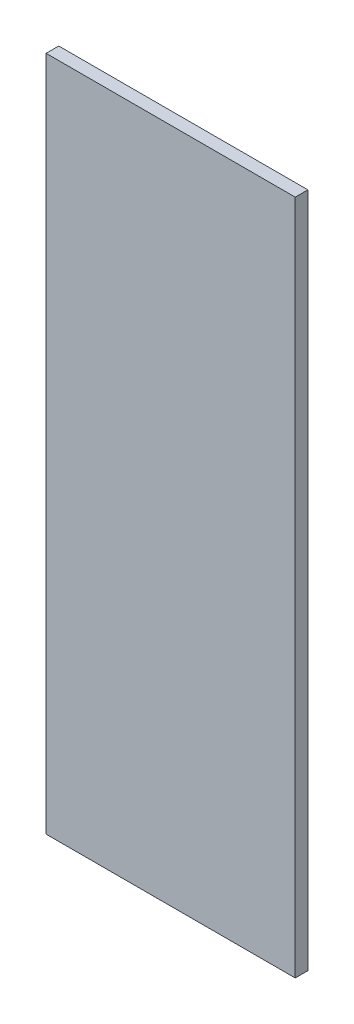
ISO-10303-21;
HEADER;
FILE_DESCRIPTION(('STEP AP214'),'2;1');
FILE_NAME('part.step','',(''),(''),'','','');
FILE_SCHEMA(('AUTOMOTIVE_DESIGN { 1 0 10303 214 1 1 1 1 }'));
ENDSEC;
DATA;
#1=APPLICATION_CONTEXT('core data for automotive mechanical design processes');
#2=APPLICATION_PROTOCOL_DEFINITION('international standard','automotive_design',2000,#1);
#3=PRODUCT_CONTEXT('',#1,'mechanical');
#4=PRODUCT('Part','Part','',(#3));
#5=PRODUCT_RELATED_PRODUCT_CATEGORY('part','',(#4));
#6=PRODUCT_DEFINITION_FORMATION('','',#4);
#7=PRODUCT_DEFINITION_CONTEXT('part definition',#1,'design');
#8=PRODUCT_DEFINITION('design','',#6,#7);
#9=PRODUCT_DEFINITION_SHAPE('','',#8);
#10=(LENGTH_UNIT() NAMED_UNIT(*) SI_UNIT(.MILLI.,.METRE.));
#11=(NAMED_UNIT(*) PLANE_ANGLE_UNIT() SI_UNIT($,.RADIAN.));
#12=(NAMED_UNIT(*) SI_UNIT($,.STERADIAN.) SOLID_ANGLE_UNIT());
#13=UNCERTAINTY_MEASURE_WITH_UNIT(LENGTH_MEASURE(1.E-05),#10,'distance_accuracy_value','');
#14=(GEOMETRIC_REPRESENTATION_CONTEXT(3) GLOBAL_UNCERTAINTY_ASSIGNED_CONTEXT((#13)) GLOBAL_UNIT_ASSIGNED_CONTEXT((#10,
#11,#12)) REPRESENTATION_CONTEXT('',''));
#15=CARTESIAN_POINT('',(0.,0.,0.));
#16=DIRECTION('',(0.,0.,1.));
#17=DIRECTION('',(1.,0.,0.));
#18=AXIS2_PLACEMENT_3D('',#15,#16,#17);
#19=CARTESIAN_POINT('',(85.4420013427734,53.8279991149902,0.));
#20=DIRECTION('',(1.,0.,0.));
#21=DIRECTION('',(0.,-1.,0.));
#22=AXIS2_PLACEMENT_3D('',#19,#20,#21);
#23=PLANE('',#22);
#24=DIRECTION('',(0.,-1.,0.));
#25=VECTOR('',#24,1.);
#26=CARTESIAN_POINT('',(85.4420013427734,53.8279991149902,0.03556));
#27=LINE('',#26,#25);
#28=CARTESIAN_POINT('',(85.4420013427734,53.8279991149902,0.03556));
#29=VERTEX_POINT('',#28);
#30=CARTESIAN_POINT('',(85.4420013427734,51.9280014038086,0.03556));
#31=VERTEX_POINT('',#30);
#32=EDGE_CURVE('E11',#29,#31,#27,.T.);
#33=ORIENTED_EDGE('',*,*,#32,.F.);
#34=DIRECTION('',(0.,0.,1.));
#35=VECTOR('',#34,1.);
#36=CARTESIAN_POINT('',(85.4420013427734,53.8279991149902,0.));
#37=LINE('',#36,#35);
#38=CARTESIAN_POINT('',(85.4420013427734,53.8279991149902,0.));
#39=VERTEX_POINT('',#38);
#40=EDGE_CURVE('E24',#39,#29,#37,.T.);
#41=ORIENTED_EDGE('',*,*,#40,.F.);
#42=DIRECTION('',(0.,-1.,0.));
#43=VECTOR('',#42,1.);
#44=CARTESIAN_POINT('',(85.4420013427734,53.8279991149902,0.));
#45=LINE('',#44,#43);
#46=CARTESIAN_POINT('',(85.4420013427734,51.9280014038086,0.));
#47=VERTEX_POINT('',#46);
#48=EDGE_CURVE('E75',#39,#47,#45,.T.);
#49=ORIENTED_EDGE('',*,*,#48,.T.);
#50=DIRECTION('',(0.,0.,1.));
#51=VECTOR('',#50,1.);
#52=CARTESIAN_POINT('',(85.4420013427734,51.9280014038086,0.));
#53=LINE('',#52,#51);
#54=EDGE_CURVE('E37',#47,#31,#53,.T.);
#55=ORIENTED_EDGE('',*,*,#54,.T.);
#56=EDGE_LOOP('',(#33,#41,#49,#55));
#57=FACE_BOUND('',#56,.T.);
#58=ADVANCED_FACE('F17',(#57),#23,.F.);
#59=CARTESIAN_POINT('',(85.4420013427734,51.9280014038086,0.));
#60=DIRECTION('',(0.,1.,0.));
#61=DIRECTION('',(1.,0.,0.));
#62=AXIS2_PLACEMENT_3D('',#59,#60,#61);
#63=PLANE('',#62);
#64=DIRECTION('',(1.,0.,0.));
#65=VECTOR('',#64,1.);
#66=CARTESIAN_POINT('',(85.4420013427734,51.9280014038086,0.03556));
#67=LINE('',#66,#65);
#68=CARTESIAN_POINT('',(86.1419982910156,51.9280014038086,0.03556));
#69=VERTEX_POINT('',#68);
#70=EDGE_CURVE('E83',#31,#69,#67,.T.);
#71=ORIENTED_EDGE('',*,*,#70,.F.);
#72=ORIENTED_EDGE('',*,*,#54,.F.);
#73=DIRECTION('',(1.,0.,0.));
#74=VECTOR('',#73,1.);
#75=CARTESIAN_POINT('',(85.4420013427734,51.9280014038086,0.));
#76=LINE('',#75,#74);
#77=CARTESIAN_POINT('',(86.1419982910156,51.9280014038086,0.));
#78=VERTEX_POINT('',#77);
#79=EDGE_CURVE('E81',#47,#78,#76,.T.);
#80=ORIENTED_EDGE('',*,*,#79,.T.);
#81=DIRECTION('',(0.,0.,1.));
#82=VECTOR('',#81,1.);
#83=CARTESIAN_POINT('',(86.1419982910156,51.9280014038086,0.));
#84=LINE('',#83,#82);
#85=EDGE_CURVE('E67',#78,#69,#84,.T.);
#86=ORIENTED_EDGE('',*,*,#85,.T.);
#87=EDGE_LOOP('',(#71,#72,#80,#86));
#88=FACE_BOUND('',#87,.T.);
#89=ADVANCED_FACE('F89',(#88),#63,.F.);
#90=CARTESIAN_POINT('',(86.1419982910156,51.9280014038086,0.));
#91=DIRECTION('',(-1.,0.,0.));
#92=DIRECTION('',(0.,1.,0.));
#93=AXIS2_PLACEMENT_3D('',#90,#91,#92);
#94=PLANE('',#93);
#95=DIRECTION('',(0.,1.,0.));
#96=VECTOR('',#95,1.);
#97=CARTESIAN_POINT('',(86.1419982910156,51.9280014038086,0.03556));
#98=LINE('',#97,#96);
#99=CARTESIAN_POINT('',(86.1419982910156,53.8279991149902,0.03556));
#100=VERTEX_POINT('',#99);
#101=EDGE_CURVE('E71',#69,#100,#98,.T.);
#102=ORIENTED_EDGE('',*,*,#101,.F.);
#103=ORIENTED_EDGE('',*,*,#85,.F.);
#104=DIRECTION('',(0.,1.,0.));
#105=VECTOR('',#104,1.);
#106=CARTESIAN_POINT('',(86.1419982910156,51.9280014038086,0.));
#107=LINE('',#106,#105);
#108=CARTESIAN_POINT('',(86.1419982910156,53.8279991149902,0.));
#109=VERTEX_POINT('',#108);
#110=EDGE_CURVE('E63',#78,#109,#107,.T.);
#111=ORIENTED_EDGE('',*,*,#110,.T.);
#112=DIRECTION('',(0.,0.,1.));
#113=VECTOR('',#112,1.);
#114=CARTESIAN_POINT('',(86.1419982910156,53.8279991149902,0.));
#115=LINE('',#114,#113);
#116=EDGE_CURVE('E53',#109,#100,#115,.T.);
#117=ORIENTED_EDGE('',*,*,#116,.T.);
#118=EDGE_LOOP('',(#102,#103,#111,#117));
#119=FACE_BOUND('',#118,.T.);
#120=ADVANCED_FACE('F66',(#119),#94,.F.);
#121=CARTESIAN_POINT('',(86.1419982910156,53.8279991149902,0.));
#122=DIRECTION('',(0.,-1.,0.));
#123=DIRECTION('',(-1.,0.,0.));
#124=AXIS2_PLACEMENT_3D('',#121,#122,#123);
#125=PLANE('',#124);
#126=DIRECTION('',(-1.,0.,0.));
#127=VECTOR('',#126,1.);
#128=CARTESIAN_POINT('',(86.1419982910156,53.8279991149902,0.03556));
#129=LINE('',#128,#127);
#130=EDGE_CURVE('E59',#100,#29,#129,.T.);
#131=ORIENTED_EDGE('',*,*,#130,.F.);
#132=ORIENTED_EDGE('',*,*,#116,.F.);
#133=DIRECTION('',(-1.,0.,0.));
#134=VECTOR('',#133,1.);
#135=CARTESIAN_POINT('',(86.1419982910156,53.8279991149902,0.));
#136=LINE('',#135,#134);
#137=EDGE_CURVE('E57',#109,#39,#136,.T.);
#138=ORIENTED_EDGE('',*,*,#137,.T.);
#139=ORIENTED_EDGE('',*,*,#40,.T.);
#140=EDGE_LOOP('',(#131,#132,#138,#139));
#141=FACE_BOUND('',#140,.T.);
#142=ADVANCED_FACE('F55',(#141),#125,.F.);
#143=CARTESIAN_POINT('',(85.4420013427734,53.8279991149902,0.));
#144=DIRECTION('',(0.,0.,-1.));
#145=DIRECTION('',(-1.,0.,0.));
#146=AXIS2_PLACEMENT_3D('',#143,#144,#145);
#147=PLANE('',#146);
#148=ORIENTED_EDGE('',*,*,#137,.F.);
#149=ORIENTED_EDGE('',*,*,#110,.F.);
#150=ORIENTED_EDGE('',*,*,#79,.F.);
#151=ORIENTED_EDGE('',*,*,#48,.F.);
#152=EDGE_LOOP('',(#148,#149,#150,#151));
#153=FACE_BOUND('',#152,.T.);
#154=ADVANCED_FACE('F74',(#153),#147,.T.);
#155=CARTESIAN_POINT('',(85.4420013427734,53.8279991149902,0.03556));
#156=DIRECTION('',(0.,0.,-1.));
#157=DIRECTION('',(-1.,0.,0.));
#158=AXIS2_PLACEMENT_3D('',#155,#156,#157);
#159=PLANE('',#158);
#160=ORIENTED_EDGE('',*,*,#32,.T.);
#161=ORIENTED_EDGE('',*,*,#70,.T.);
#162=ORIENTED_EDGE('',*,*,#101,.T.);
#163=ORIENTED_EDGE('',*,*,#130,.T.);
#164=EDGE_LOOP('',(#160,#161,#162,#163));
#165=FACE_BOUND('',#164,.T.);
#166=ADVANCED_FACE('F91',(#165),#159,.F.);
#167=CLOSED_SHELL('',(#58,#89,#120,#142,#154,#166));
#168=MANIFOLD_SOLID_BREP('B1',#167);
#169=ADVANCED_BREP_SHAPE_REPRESENTATION('',(#18,#168),#14);
#170=SHAPE_DEFINITION_REPRESENTATION(#9,#169);
ENDSEC;
END-ISO-10303-21;
